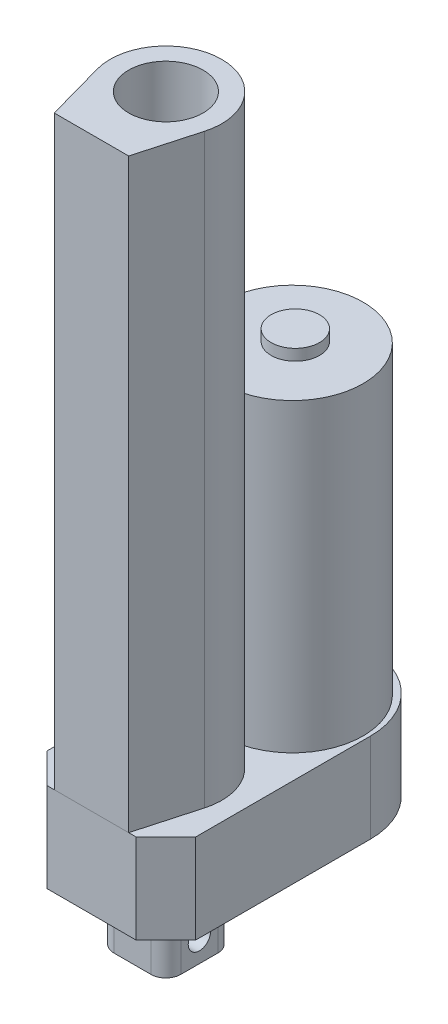
ISO-10303-21;
HEADER;
FILE_DESCRIPTION(('STEP AP214'),'2;1');
FILE_NAME('part.step','',(''),(''),'','','');
FILE_SCHEMA(('AUTOMOTIVE_DESIGN { 1 0 10303 214 1 1 1 1 }'));
ENDSEC;
DATA;
#1=APPLICATION_CONTEXT('core data for automotive mechanical design processes');
#2=APPLICATION_PROTOCOL_DEFINITION('international standard','automotive_design',2000,#1);
#3=PRODUCT_CONTEXT('',#1,'mechanical');
#4=PRODUCT('Part','Part','',(#3));
#5=PRODUCT_RELATED_PRODUCT_CATEGORY('part','',(#4));
#6=PRODUCT_DEFINITION_FORMATION('','',#4);
#7=PRODUCT_DEFINITION_CONTEXT('part definition',#1,'design');
#8=PRODUCT_DEFINITION('design','',#6,#7);
#9=PRODUCT_DEFINITION_SHAPE('','',#8);
#10=(LENGTH_UNIT() NAMED_UNIT(*) SI_UNIT(.MILLI.,.METRE.));
#11=(NAMED_UNIT(*) PLANE_ANGLE_UNIT() SI_UNIT($,.RADIAN.));
#12=(NAMED_UNIT(*) SI_UNIT($,.STERADIAN.) SOLID_ANGLE_UNIT());
#13=UNCERTAINTY_MEASURE_WITH_UNIT(LENGTH_MEASURE(1.E-05),#10,'distance_accuracy_value','');
#14=(GEOMETRIC_REPRESENTATION_CONTEXT(3) GLOBAL_UNCERTAINTY_ASSIGNED_CONTEXT((#13)) GLOBAL_UNIT_ASSIGNED_CONTEXT((#10,
#11,#12)) REPRESENTATION_CONTEXT('',''));
#15=CARTESIAN_POINT('',(0.,0.,0.));
#16=DIRECTION('',(0.,0.,1.));
#17=DIRECTION('',(1.,0.,0.));
#18=AXIS2_PLACEMENT_3D('',#15,#16,#17);
#19=CARTESIAN_POINT('',(20.,181.5,-20.));
#20=DIRECTION('',(0.,1.,0.));
#21=DIRECTION('',(0.,0.,1.));
#22=AXIS2_PLACEMENT_3D('',#19,#20,#21);
#23=PLANE('',#22);
#24=DIRECTION('',(1.,0.,0.));
#25=VECTOR('',#24,1.);
#26=CARTESIAN_POINT('',(30.,181.5,0.));
#27=LINE('',#26,#25);
#28=CARTESIAN_POINT('',(10.,181.5,0.));
#29=VERTEX_POINT('',#28);
#30=CARTESIAN_POINT('',(30.,181.5,0.));
#31=VERTEX_POINT('',#30);
#32=EDGE_CURVE('E96',#29,#31,#27,.T.);
#33=ORIENTED_EDGE('',*,*,#32,.T.);
#34=DIRECTION('',(0.26833752096446,0.,-0.96332495807108));
#35=VECTOR('',#34,1.);
#36=CARTESIAN_POINT('',(30.,181.5,0.));
#37=LINE('',#36,#35);
#38=CARTESIAN_POINT('',(34.4498743710662,181.5,-15.9749371855331));
#39=VERTEX_POINT('',#38);
#40=EDGE_CURVE('E91',#31,#39,#37,.T.);
#41=ORIENTED_EDGE('',*,*,#40,.T.);
#42=CARTESIAN_POINT('',(20.,181.5,-20.));
#43=DIRECTION('',(0.,1.,0.));
#44=DIRECTION('',(0.,0.,1.));
#45=AXIS2_PLACEMENT_3D('',#42,#43,#44);
#46=CIRCLE('',#45,15.);
#47=CARTESIAN_POINT('',(5.5501256289338,181.5,-15.9749371855331));
#48=VERTEX_POINT('',#47);
#49=EDGE_CURVE('E94',#39,#48,#46,.T.);
#50=ORIENTED_EDGE('',*,*,#49,.T.);
#51=DIRECTION('',(0.26833752096446,0.,0.96332495807108));
#52=VECTOR('',#51,1.);
#53=CARTESIAN_POINT('',(10.,181.5,0.));
#54=LINE('',#53,#52);
#55=EDGE_CURVE('E61',#48,#29,#54,.T.);
#56=ORIENTED_EDGE('',*,*,#55,.T.);
#57=EDGE_LOOP('',(#33,#41,#50,#56));
#58=FACE_BOUND('',#57,.T.);
#59=CARTESIAN_POINT('',(20.,181.5,-20.));
#60=DIRECTION('',(0.,1.,0.));
#61=DIRECTION('',(0.,0.,1.));
#62=AXIS2_PLACEMENT_3D('',#59,#60,#61);
#63=CIRCLE('',#62,10.);
#64=CARTESIAN_POINT('',(20.,181.5,-9.99999999999999));
#65=VERTEX_POINT('',#64);
#66=EDGE_CURVE('E111',#65,#65,#63,.T.);
#67=ORIENTED_EDGE('',*,*,#66,.F.);
#68=EDGE_LOOP('',(#67));
#69=FACE_BOUND('',#68,.T.);
#70=ADVANCED_FACE('F44',(#58,#69),#23,.T.);
#71=CARTESIAN_POINT('',(20.,24.,-20.));
#72=DIRECTION('',(0.,1.,0.));
#73=DIRECTION('',(0.,0.,1.));
#74=AXIS2_PLACEMENT_3D('',#71,#72,#73);
#75=PLANE('',#74);
#76=DIRECTION('',(1.,0.,0.));
#77=VECTOR('',#76,1.);
#78=CARTESIAN_POINT('',(30.,24.,0.));
#79=LINE('',#78,#77);
#80=CARTESIAN_POINT('',(10.,24.,0.));
#81=VERTEX_POINT('',#80);
#82=CARTESIAN_POINT('',(30.,24.,0.));
#83=VERTEX_POINT('',#82);
#84=EDGE_CURVE('E108',#81,#83,#79,.T.);
#85=ORIENTED_EDGE('',*,*,#84,.F.);
#86=DIRECTION('',(0.26833752096446,0.,0.96332495807108));
#87=VECTOR('',#86,1.);
#88=CARTESIAN_POINT('',(10.,24.,0.));
#89=LINE('',#88,#87);
#90=CARTESIAN_POINT('',(5.5501256289338,24.,-15.9749371855331));
#91=VERTEX_POINT('',#90);
#92=EDGE_CURVE('E84',#91,#81,#89,.T.);
#93=ORIENTED_EDGE('',*,*,#92,.F.);
#94=CARTESIAN_POINT('',(20.,24.,-20.));
#95=DIRECTION('',(0.,1.,0.));
#96=DIRECTION('',(0.,0.,1.));
#97=AXIS2_PLACEMENT_3D('',#94,#95,#96);
#98=CIRCLE('',#97,15.);
#99=CARTESIAN_POINT('',(34.4498743710662,24.,-15.9749371855331));
#100=VERTEX_POINT('',#99);
#101=EDGE_CURVE('E78',#100,#91,#98,.T.);
#102=ORIENTED_EDGE('',*,*,#101,.F.);
#103=DIRECTION('',(0.26833752096446,0.,-0.96332495807108));
#104=VECTOR('',#103,1.);
#105=CARTESIAN_POINT('',(30.,24.,0.));
#106=LINE('',#105,#104);
#107=EDGE_CURVE('E100',#83,#100,#106,.T.);
#108=ORIENTED_EDGE('',*,*,#107,.F.);
#109=EDGE_LOOP('',(#85,#93,#102,#108));
#110=FACE_BOUND('',#109,.T.);
#111=CARTESIAN_POINT('',(20.,24.,-20.));
#112=DIRECTION('',(0.,1.,0.));
#113=DIRECTION('',(0.,0.,1.));
#114=AXIS2_PLACEMENT_3D('',#111,#112,#113);
#115=CIRCLE('',#114,10.);
#116=CARTESIAN_POINT('',(20.,24.,-9.99999999999999));
#117=VERTEX_POINT('',#116);
#118=EDGE_CURVE('E123',#117,#117,#115,.T.);
#119=ORIENTED_EDGE('',*,*,#118,.T.);
#120=EDGE_LOOP('',(#119));
#121=FACE_BOUND('',#120,.T.);
#122=ADVANCED_FACE('F119',(#110,#121),#75,.F.);
#123=CARTESIAN_POINT('',(30.,181.5,0.));
#124=DIRECTION('',(0.,0.,-1.));
#125=DIRECTION('',(-1.,0.,0.));
#126=AXIS2_PLACEMENT_3D('',#123,#124,#125);
#127=PLANE('',#126);
#128=ORIENTED_EDGE('',*,*,#84,.T.);
#129=DIRECTION('',(0.,-1.,0.));
#130=VECTOR('',#129,1.);
#131=CARTESIAN_POINT('',(30.,181.5,0.));
#132=LINE('',#131,#130);
#133=EDGE_CURVE('E12',#31,#83,#132,.T.);
#134=ORIENTED_EDGE('',*,*,#133,.F.);
#135=ORIENTED_EDGE('',*,*,#32,.F.);
#136=DIRECTION('',(0.,-1.,0.));
#137=VECTOR('',#136,1.);
#138=CARTESIAN_POINT('',(10.,181.5,0.));
#139=LINE('',#138,#137);
#140=EDGE_CURVE('E104',#29,#81,#139,.T.);
#141=ORIENTED_EDGE('',*,*,#140,.T.);
#142=EDGE_LOOP('',(#128,#134,#135,#141));
#143=FACE_BOUND('',#142,.T.);
#144=ADVANCED_FACE('F46',(#143),#127,.F.);
#145=CARTESIAN_POINT('',(30.,181.5,0.));
#146=DIRECTION('',(-0.96332495807108,0.,-0.26833752096446));
#147=DIRECTION('',(-0.26833752096446,0.,0.96332495807108));
#148=AXIS2_PLACEMENT_3D('',#145,#146,#147);
#149=PLANE('',#148);
#150=ORIENTED_EDGE('',*,*,#107,.T.);
#151=DIRECTION('',(0.,-1.,0.));
#152=VECTOR('',#151,1.);
#153=CARTESIAN_POINT('',(34.4498743710662,181.5,-15.9749371855331));
#154=LINE('',#153,#152);
#155=EDGE_CURVE('E53',#39,#100,#154,.T.);
#156=ORIENTED_EDGE('',*,*,#155,.F.);
#157=ORIENTED_EDGE('',*,*,#40,.F.);
#158=ORIENTED_EDGE('',*,*,#133,.T.);
#159=EDGE_LOOP('',(#150,#156,#157,#158));
#160=FACE_BOUND('',#159,.T.);
#161=ADVANCED_FACE('F99',(#160),#149,.F.);
#162=CARTESIAN_POINT('',(20.,181.5,-20.));
#163=DIRECTION('',(0.,-1.,0.));
#164=DIRECTION('',(0.,0.,-1.));
#165=AXIS2_PLACEMENT_3D('',#162,#163,#164);
#166=CYLINDRICAL_SURFACE('',#165,15.);
#167=ORIENTED_EDGE('',*,*,#101,.T.);
#168=DIRECTION('',(0.,-1.,0.));
#169=VECTOR('',#168,1.);
#170=CARTESIAN_POINT('',(5.5501256289338,181.5,-15.9749371855331));
#171=LINE('',#170,#169);
#172=EDGE_CURVE('E101',#48,#91,#171,.T.);
#173=ORIENTED_EDGE('',*,*,#172,.F.);
#174=ORIENTED_EDGE('',*,*,#49,.F.);
#175=ORIENTED_EDGE('',*,*,#155,.T.);
#176=EDGE_LOOP('',(#167,#173,#174,#175));
#177=FACE_BOUND('',#176,.T.);
#178=ADVANCED_FACE('F102',(#177),#166,.T.);
#179=CARTESIAN_POINT('',(10.,181.5,0.));
#180=DIRECTION('',(0.96332495807108,0.,-0.26833752096446));
#181=DIRECTION('',(-0.26833752096446,0.,-0.96332495807108));
#182=AXIS2_PLACEMENT_3D('',#179,#180,#181);
#183=PLANE('',#182);
#184=ORIENTED_EDGE('',*,*,#92,.T.);
#185=ORIENTED_EDGE('',*,*,#140,.F.);
#186=ORIENTED_EDGE('',*,*,#55,.F.);
#187=ORIENTED_EDGE('',*,*,#172,.T.);
#188=EDGE_LOOP('',(#184,#185,#186,#187));
#189=FACE_BOUND('',#188,.T.);
#190=ADVANCED_FACE('F116',(#189),#183,.F.);
#191=CARTESIAN_POINT('',(20.,181.5,-20.));
#192=DIRECTION('',(0.,-1.,0.));
#193=DIRECTION('',(0.,0.,-1.));
#194=AXIS2_PLACEMENT_3D('',#191,#192,#193);
#195=CYLINDRICAL_SURFACE('',#194,10.);
#196=ORIENTED_EDGE('',*,*,#66,.T.);
#197=EDGE_LOOP('',(#196));
#198=FACE_BOUND('',#197,.T.);
#199=ORIENTED_EDGE('',*,*,#118,.F.);
#200=EDGE_LOOP('',(#199));
#201=FACE_BOUND('',#200,.T.);
#202=ADVANCED_FACE('F129',(#198,#201),#195,.F.);
#203=CLOSED_SHELL('',(#70,#122,#144,#161,#178,#190,#202));
#204=MANIFOLD_SOLID_BREP('B2',#203);
#205=CARTESIAN_POINT('',(20.,0.,-55.));
#206=DIRECTION('',(0.,1.,0.));
#207=DIRECTION('',(0.,0.,1.));
#208=AXIS2_PLACEMENT_3D('',#205,#206,#207);
#209=PLANE('',#208);
#210=DIRECTION('',(1.,0.,0.));
#211=VECTOR('',#210,1.);
#212=CARTESIAN_POINT('',(8.,0.,0.));
#213=LINE('',#212,#211);
#214=CARTESIAN_POINT('',(8.,0.,0.));
#215=VERTEX_POINT('',#214);
#216=CARTESIAN_POINT('',(32.,0.,0.));
#217=VERTEX_POINT('',#216);
#218=EDGE_CURVE('E312',#215,#217,#213,.T.);
#219=ORIENTED_EDGE('',*,*,#218,.F.);
#220=DIRECTION('',(0.707106781186548,0.,0.707106781186548));
#221=VECTOR('',#220,1.);
#222=CARTESIAN_POINT('',(0.,0.,-8.));
#223=LINE('',#222,#221);
#224=CARTESIAN_POINT('',(0.,0.,-8.));
#225=VERTEX_POINT('',#224);
#226=EDGE_CURVE('E325',#225,#215,#223,.T.);
#227=ORIENTED_EDGE('',*,*,#226,.F.);
#228=DIRECTION('',(0.,0.,1.));
#229=VECTOR('',#228,1.);
#230=CARTESIAN_POINT('',(0.,0.,-8.));
#231=LINE('',#230,#229);
#232=CARTESIAN_POINT('',(0.,0.,-55.));
#233=VERTEX_POINT('',#232);
#234=EDGE_CURVE('E341',#233,#225,#231,.T.);
#235=ORIENTED_EDGE('',*,*,#234,.F.);
#236=CARTESIAN_POINT('',(20.,0.,-55.));
#237=DIRECTION('',(0.,1.,0.));
#238=DIRECTION('',(0.,0.,1.));
#239=AXIS2_PLACEMENT_3D('',#236,#237,#238);
#240=CIRCLE('',#239,20.);
#241=CARTESIAN_POINT('',(40.,0.,-55.));
#242=VERTEX_POINT('',#241);
#243=EDGE_CURVE('E339',#242,#233,#240,.T.);
#244=ORIENTED_EDGE('',*,*,#243,.F.);
#245=DIRECTION('',(0.,0.,-1.));
#246=VECTOR('',#245,1.);
#247=CARTESIAN_POINT('',(40.,0.,-8.));
#248=LINE('',#247,#246);
#249=CARTESIAN_POINT('',(40.,0.,-8.));
#250=VERTEX_POINT('',#249);
#251=EDGE_CURVE('E337',#250,#242,#248,.T.);
#252=ORIENTED_EDGE('',*,*,#251,.F.);
#253=DIRECTION('',(0.707106781186548,0.,-0.707106781186548));
#254=VECTOR('',#253,1.);
#255=CARTESIAN_POINT('',(32.,0.,0.));
#256=LINE('',#255,#254);
#257=EDGE_CURVE('E315',#217,#250,#256,.T.);
#258=ORIENTED_EDGE('',*,*,#257,.F.);
#259=EDGE_LOOP('',(#219,#227,#235,#244,#252,#258));
#260=FACE_BOUND('',#259,.T.);
#261=CARTESIAN_POINT('',(15.,0.,-25.));
#262=DIRECTION('',(0.,-1.,0.));
#263=DIRECTION('',(0.,0.,-1.));
#264=AXIS2_PLACEMENT_3D('',#261,#262,#263);
#265=CIRCLE('',#264,4.);
#266=CARTESIAN_POINT('',(11.,0.,-25.));
#267=VERTEX_POINT('',#266);
#268=CARTESIAN_POINT('',(15.,0.,-29.));
#269=VERTEX_POINT('',#268);
#270=EDGE_CURVE('E311',#267,#269,#265,.T.);
#271=ORIENTED_EDGE('',*,*,#270,.F.);
#272=DIRECTION('',(0.,0.,-1.));
#273=VECTOR('',#272,1.);
#274=CARTESIAN_POINT('',(11.,0.,-15.));
#275=LINE('',#274,#273);
#276=CARTESIAN_POINT('',(11.,0.,-15.));
#277=VERTEX_POINT('',#276);
#278=EDGE_CURVE('E308',#277,#267,#275,.T.);
#279=ORIENTED_EDGE('',*,*,#278,.F.);
#280=CARTESIAN_POINT('',(15.,0.,-15.));
#281=DIRECTION('',(0.,-1.,0.));
#282=DIRECTION('',(0.,0.,-1.));
#283=AXIS2_PLACEMENT_3D('',#280,#281,#282);
#284=CIRCLE('',#283,4.);
#285=CARTESIAN_POINT('',(15.,0.,-11.));
#286=VERTEX_POINT('',#285);
#287=EDGE_CURVE('E493',#286,#277,#284,.T.);
#288=ORIENTED_EDGE('',*,*,#287,.F.);
#289=DIRECTION('',(-1.,0.,0.));
#290=VECTOR('',#289,1.);
#291=CARTESIAN_POINT('',(15.,0.,-11.));
#292=LINE('',#291,#290);
#293=CARTESIAN_POINT('',(25.,0.,-11.));
#294=VERTEX_POINT('',#293);
#295=EDGE_CURVE('E490',#294,#286,#292,.T.);
#296=ORIENTED_EDGE('',*,*,#295,.F.);
#297=CARTESIAN_POINT('',(25.,0.,-15.));
#298=DIRECTION('',(0.,-1.,0.));
#299=DIRECTION('',(0.,0.,1.));
#300=AXIS2_PLACEMENT_3D('',#297,#298,#299);
#301=CIRCLE('',#300,4.);
#302=CARTESIAN_POINT('',(29.,0.,-15.));
#303=VERTEX_POINT('',#302);
#304=EDGE_CURVE('E487',#303,#294,#301,.T.);
#305=ORIENTED_EDGE('',*,*,#304,.F.);
#306=DIRECTION('',(0.,0.,1.));
#307=VECTOR('',#306,1.);
#308=CARTESIAN_POINT('',(29.,0.,-15.));
#309=LINE('',#308,#307);
#310=CARTESIAN_POINT('',(29.,0.,-25.));
#311=VERTEX_POINT('',#310);
#312=EDGE_CURVE('E484',#311,#303,#309,.T.);
#313=ORIENTED_EDGE('',*,*,#312,.F.);
#314=CARTESIAN_POINT('',(25.,0.,-25.));
#315=DIRECTION('',(0.,-1.,0.));
#316=DIRECTION('',(0.,0.,-1.));
#317=AXIS2_PLACEMENT_3D('',#314,#315,#316);
#318=CIRCLE('',#317,4.);
#319=CARTESIAN_POINT('',(25.,0.,-29.));
#320=VERTEX_POINT('',#319);
#321=EDGE_CURVE('E210',#320,#311,#318,.T.);
#322=ORIENTED_EDGE('',*,*,#321,.F.);
#323=DIRECTION('',(1.,0.,0.));
#324=VECTOR('',#323,1.);
#325=CARTESIAN_POINT('',(15.,0.,-29.));
#326=LINE('',#325,#324);
#327=EDGE_CURVE('E205',#269,#320,#326,.T.);
#328=ORIENTED_EDGE('',*,*,#327,.F.);
#329=EDGE_LOOP('',(#271,#279,#288,#296,#305,#313,#322,#328));
#330=FACE_BOUND('',#329,.T.);
#331=ADVANCED_FACE('F188',(#260,#330),#209,.F.);
#332=CARTESIAN_POINT('',(8.,24.,0.));
#333=DIRECTION('',(0.,0.,-1.));
#334=DIRECTION('',(-1.,0.,0.));
#335=AXIS2_PLACEMENT_3D('',#332,#333,#334);
#336=PLANE('',#335);
#337=ORIENTED_EDGE('',*,*,#218,.T.);
#338=DIRECTION('',(0.,-1.,0.));
#339=VECTOR('',#338,1.);
#340=CARTESIAN_POINT('',(32.,24.,0.));
#341=LINE('',#340,#339);
#342=CARTESIAN_POINT('',(32.,24.,0.));
#343=VERTEX_POINT('',#342);
#344=EDGE_CURVE('E197',#343,#217,#341,.T.);
#345=ORIENTED_EDGE('',*,*,#344,.F.);
#346=DIRECTION('',(1.,0.,0.));
#347=VECTOR('',#346,1.);
#348=CARTESIAN_POINT('',(8.,24.,0.));
#349=LINE('',#348,#347);
#350=CARTESIAN_POINT('',(8.,24.,0.));
#351=VERTEX_POINT('',#350);
#352=EDGE_CURVE('E321',#351,#343,#349,.T.);
#353=ORIENTED_EDGE('',*,*,#352,.F.);
#354=DIRECTION('',(0.,-1.,0.));
#355=VECTOR('',#354,1.);
#356=CARTESIAN_POINT('',(8.,24.,0.));
#357=LINE('',#356,#355);
#358=EDGE_CURVE('E334',#351,#215,#357,.T.);
#359=ORIENTED_EDGE('',*,*,#358,.T.);
#360=EDGE_LOOP('',(#337,#345,#353,#359));
#361=FACE_BOUND('',#360,.T.);
#362=ADVANCED_FACE('F190',(#361),#336,.F.);
#363=CARTESIAN_POINT('',(32.,24.,0.));
#364=DIRECTION('',(-0.707106781186547,0.,-0.707106781186547));
#365=DIRECTION('',(-0.707106781186548,0.,0.707106781186548));
#366=AXIS2_PLACEMENT_3D('',#363,#364,#365);
#367=PLANE('',#366);
#368=ORIENTED_EDGE('',*,*,#257,.T.);
#369=DIRECTION('',(0.,-1.,0.));
#370=VECTOR('',#369,1.);
#371=CARTESIAN_POINT('',(40.,24.,-8.));
#372=LINE('',#371,#370);
#373=CARTESIAN_POINT('',(40.,24.,-8.));
#374=VERTEX_POINT('',#373);
#375=EDGE_CURVE('E355',#374,#250,#372,.T.);
#376=ORIENTED_EDGE('',*,*,#375,.F.);
#377=DIRECTION('',(0.707106781186548,0.,-0.707106781186548));
#378=VECTOR('',#377,1.);
#379=CARTESIAN_POINT('',(32.,24.,0.));
#380=LINE('',#379,#378);
#381=EDGE_CURVE('E324',#343,#374,#380,.T.);
#382=ORIENTED_EDGE('',*,*,#381,.F.);
#383=ORIENTED_EDGE('',*,*,#344,.T.);
#384=EDGE_LOOP('',(#368,#376,#382,#383));
#385=FACE_BOUND('',#384,.T.);
#386=ADVANCED_FACE('F360',(#385),#367,.F.);
#387=CARTESIAN_POINT('',(40.,24.,-8.));
#388=DIRECTION('',(-1.,0.,0.));
#389=DIRECTION('',(0.,0.,1.));
#390=AXIS2_PLACEMENT_3D('',#387,#388,#389);
#391=PLANE('',#390);
#392=ORIENTED_EDGE('',*,*,#251,.T.);
#393=DIRECTION('',(0.,-1.,0.));
#394=VECTOR('',#393,1.);
#395=CARTESIAN_POINT('',(40.,24.,-55.));
#396=LINE('',#395,#394);
#397=CARTESIAN_POINT('',(40.,24.,-55.));
#398=VERTEX_POINT('',#397);
#399=EDGE_CURVE('E352',#398,#242,#396,.T.);
#400=ORIENTED_EDGE('',*,*,#399,.F.);
#401=DIRECTION('',(0.,0.,-1.));
#402=VECTOR('',#401,1.);
#403=CARTESIAN_POINT('',(40.,24.,-8.));
#404=LINE('',#403,#402);
#405=EDGE_CURVE('E327',#374,#398,#404,.T.);
#406=ORIENTED_EDGE('',*,*,#405,.F.);
#407=ORIENTED_EDGE('',*,*,#375,.T.);
#408=EDGE_LOOP('',(#392,#400,#406,#407));
#409=FACE_BOUND('',#408,.T.);
#410=ADVANCED_FACE('F373',(#409),#391,.F.);
#411=CARTESIAN_POINT('',(20.,24.,-55.));
#412=DIRECTION('',(0.,-1.,0.));
#413=DIRECTION('',(0.,0.,-1.));
#414=AXIS2_PLACEMENT_3D('',#411,#412,#413);
#415=CYLINDRICAL_SURFACE('',#414,20.);
#416=ORIENTED_EDGE('',*,*,#243,.T.);
#417=DIRECTION('',(0.,-1.,0.));
#418=VECTOR('',#417,1.);
#419=CARTESIAN_POINT('',(0.,24.,-55.));
#420=LINE('',#419,#418);
#421=CARTESIAN_POINT('',(0.,24.,-55.));
#422=VERTEX_POINT('',#421);
#423=EDGE_CURVE('E349',#422,#233,#420,.T.);
#424=ORIENTED_EDGE('',*,*,#423,.F.);
#425=CARTESIAN_POINT('',(20.,24.,-55.));
#426=DIRECTION('',(0.,1.,0.));
#427=DIRECTION('',(0.,0.,1.));
#428=AXIS2_PLACEMENT_3D('',#425,#426,#427);
#429=CIRCLE('',#428,20.);
#430=EDGE_CURVE('E329',#398,#422,#429,.T.);
#431=ORIENTED_EDGE('',*,*,#430,.F.);
#432=ORIENTED_EDGE('',*,*,#399,.T.);
#433=EDGE_LOOP('',(#416,#424,#431,#432));
#434=FACE_BOUND('',#433,.T.);
#435=ADVANCED_FACE('F377',(#434),#415,.T.);
#436=CARTESIAN_POINT('',(0.,24.,-8.));
#437=DIRECTION('',(1.,0.,0.));
#438=DIRECTION('',(0.,0.,-1.));
#439=AXIS2_PLACEMENT_3D('',#436,#437,#438);
#440=PLANE('',#439);
#441=ORIENTED_EDGE('',*,*,#234,.T.);
#442=DIRECTION('',(0.,-1.,0.));
#443=VECTOR('',#442,1.);
#444=CARTESIAN_POINT('',(0.,24.,-8.));
#445=LINE('',#444,#443);
#446=CARTESIAN_POINT('',(0.,24.,-8.));
#447=VERTEX_POINT('',#446);
#448=EDGE_CURVE('E346',#447,#225,#445,.T.);
#449=ORIENTED_EDGE('',*,*,#448,.F.);
#450=DIRECTION('',(0.,0.,1.));
#451=VECTOR('',#450,1.);
#452=CARTESIAN_POINT('',(0.,24.,-8.));
#453=LINE('',#452,#451);
#454=EDGE_CURVE('E331',#422,#447,#453,.T.);
#455=ORIENTED_EDGE('',*,*,#454,.F.);
#456=ORIENTED_EDGE('',*,*,#423,.T.);
#457=EDGE_LOOP('',(#441,#449,#455,#456));
#458=FACE_BOUND('',#457,.T.);
#459=ADVANCED_FACE('F387',(#458),#440,.F.);
#460=CARTESIAN_POINT('',(0.,24.,-8.));
#461=DIRECTION('',(0.707106781186547,0.,-0.707106781186547));
#462=DIRECTION('',(-0.707106781186548,0.,-0.707106781186548));
#463=AXIS2_PLACEMENT_3D('',#460,#461,#462);
#464=PLANE('',#463);
#465=ORIENTED_EDGE('',*,*,#226,.T.);
#466=ORIENTED_EDGE('',*,*,#358,.F.);
#467=DIRECTION('',(0.707106781186548,0.,0.707106781186548));
#468=VECTOR('',#467,1.);
#469=CARTESIAN_POINT('',(0.,24.,-8.));
#470=LINE('',#469,#468);
#471=EDGE_CURVE('E333',#447,#351,#470,.T.);
#472=ORIENTED_EDGE('',*,*,#471,.F.);
#473=ORIENTED_EDGE('',*,*,#448,.T.);
#474=EDGE_LOOP('',(#465,#466,#472,#473));
#475=FACE_BOUND('',#474,.T.);
#476=ADVANCED_FACE('F385',(#475),#464,.F.);
#477=CARTESIAN_POINT('',(20.,24.,-55.));
#478=DIRECTION('',(0.,1.,0.));
#479=DIRECTION('',(0.,0.,1.));
#480=AXIS2_PLACEMENT_3D('',#477,#478,#479);
#481=PLANE('',#480);
#482=CARTESIAN_POINT('',(20.,24.,-54.));
#483=DIRECTION('',(0.,1.,0.));
#484=DIRECTION('',(0.,0.,1.));
#485=AXIS2_PLACEMENT_3D('',#482,#483,#484);
#486=CIRCLE('',#485,19.);
#487=CARTESIAN_POINT('',(20.,24.,-35.));
#488=VERTEX_POINT('',#487);
#489=EDGE_CURVE('E459',#488,#488,#486,.T.);
#490=ORIENTED_EDGE('',*,*,#489,.F.);
#491=EDGE_LOOP('',(#490));
#492=FACE_BOUND('',#491,.T.);
#493=ORIENTED_EDGE('',*,*,#352,.T.);
#494=ORIENTED_EDGE('',*,*,#381,.T.);
#495=ORIENTED_EDGE('',*,*,#405,.T.);
#496=ORIENTED_EDGE('',*,*,#430,.T.);
#497=ORIENTED_EDGE('',*,*,#454,.T.);
#498=ORIENTED_EDGE('',*,*,#471,.T.);
#499=EDGE_LOOP('',(#493,#494,#495,#496,#497,#498));
#500=FACE_BOUND('',#499,.T.);
#501=ADVANCED_FACE('F381',(#492,#500),#481,.T.);
#502=CARTESIAN_POINT('',(15.,-17.,-25.));
#503=DIRECTION('',(0.,1.,0.));
#504=DIRECTION('',(0.,0.,1.));
#505=AXIS2_PLACEMENT_3D('',#502,#503,#504);
#506=CYLINDRICAL_SURFACE('',#505,4.);
#507=ORIENTED_EDGE('',*,*,#270,.T.);
#508=DIRECTION('',(0.,1.,0.));
#509=VECTOR('',#508,1.);
#510=CARTESIAN_POINT('',(15.,-17.,-29.));
#511=LINE('',#510,#509);
#512=CARTESIAN_POINT('',(15.,-17.,-29.));
#513=VERTEX_POINT('',#512);
#514=EDGE_CURVE('E292',#513,#269,#511,.T.);
#515=ORIENTED_EDGE('',*,*,#514,.F.);
#516=CARTESIAN_POINT('',(15.,-17.,-25.));
#517=DIRECTION('',(0.,-1.,0.));
#518=DIRECTION('',(0.,0.,-1.));
#519=AXIS2_PLACEMENT_3D('',#516,#517,#518);
#520=CIRCLE('',#519,4.);
#521=CARTESIAN_POINT('',(11.,-17.,-25.));
#522=VERTEX_POINT('',#521);
#523=EDGE_CURVE('E299',#522,#513,#520,.T.);
#524=ORIENTED_EDGE('',*,*,#523,.F.);
#525=DIRECTION('',(0.,1.,0.));
#526=VECTOR('',#525,1.);
#527=CARTESIAN_POINT('',(11.,-17.,-25.));
#528=LINE('',#527,#526);
#529=EDGE_CURVE('E480',#522,#267,#528,.T.);
#530=ORIENTED_EDGE('',*,*,#529,.T.);
#531=EDGE_LOOP('',(#507,#515,#524,#530));
#532=FACE_BOUND('',#531,.T.);
#533=ADVANCED_FACE('F310',(#532),#506,.T.);
#534=CARTESIAN_POINT('',(15.,-17.,-29.));
#535=DIRECTION('',(0.,0.,1.));
#536=DIRECTION('',(1.,0.,0.));
#537=AXIS2_PLACEMENT_3D('',#534,#535,#536);
#538=PLANE('',#537);
#539=ORIENTED_EDGE('',*,*,#327,.T.);
#540=DIRECTION('',(0.,1.,0.));
#541=VECTOR('',#540,1.);
#542=CARTESIAN_POINT('',(25.,-17.,-29.));
#543=LINE('',#542,#541);
#544=CARTESIAN_POINT('',(25.,-17.,-29.));
#545=VERTEX_POINT('',#544);
#546=EDGE_CURVE('E295',#545,#320,#543,.T.);
#547=ORIENTED_EDGE('',*,*,#546,.F.);
#548=DIRECTION('',(1.,0.,0.));
#549=VECTOR('',#548,1.);
#550=CARTESIAN_POINT('',(15.,-17.,-29.));
#551=LINE('',#550,#549);
#552=EDGE_CURVE('E288',#513,#545,#551,.T.);
#553=ORIENTED_EDGE('',*,*,#552,.F.);
#554=ORIENTED_EDGE('',*,*,#514,.T.);
#555=EDGE_LOOP('',(#539,#547,#553,#554));
#556=FACE_BOUND('',#555,.T.);
#557=ADVANCED_FACE('F290',(#556),#538,.F.);
#558=CARTESIAN_POINT('',(25.,-17.,-25.));
#559=DIRECTION('',(0.,1.,0.));
#560=DIRECTION('',(0.,0.,1.));
#561=AXIS2_PLACEMENT_3D('',#558,#559,#560);
#562=CYLINDRICAL_SURFACE('',#561,4.);
#563=ORIENTED_EDGE('',*,*,#321,.T.);
#564=DIRECTION('',(0.,1.,0.));
#565=VECTOR('',#564,1.);
#566=CARTESIAN_POINT('',(29.,-17.,-25.));
#567=LINE('',#566,#565);
#568=CARTESIAN_POINT('',(29.,-17.,-25.));
#569=VERTEX_POINT('',#568);
#570=EDGE_CURVE('E317',#569,#311,#567,.T.);
#571=ORIENTED_EDGE('',*,*,#570,.F.);
#572=CARTESIAN_POINT('',(25.,-17.,-25.));
#573=DIRECTION('',(0.,-1.,0.));
#574=DIRECTION('',(0.,0.,-1.));
#575=AXIS2_PLACEMENT_3D('',#572,#573,#574);
#576=CIRCLE('',#575,4.);
#577=EDGE_CURVE('E298',#545,#569,#576,.T.);
#578=ORIENTED_EDGE('',*,*,#577,.F.);
#579=ORIENTED_EDGE('',*,*,#546,.T.);
#580=EDGE_LOOP('',(#563,#571,#578,#579));
#581=FACE_BOUND('',#580,.T.);
#582=ADVANCED_FACE('F409',(#581),#562,.T.);
#583=CARTESIAN_POINT('',(29.,-17.,-15.));
#584=DIRECTION('',(-1.,0.,0.));
#585=DIRECTION('',(0.,0.,1.));
#586=AXIS2_PLACEMENT_3D('',#583,#584,#585);
#587=PLANE('',#586);
#588=CARTESIAN_POINT('',(29.,-11.,-20.));
#589=DIRECTION('',(-1.,0.,0.));
#590=DIRECTION('',(0.,0.,1.));
#591=AXIS2_PLACEMENT_3D('',#588,#589,#590);
#592=CIRCLE('',#591,3.);
#593=CARTESIAN_POINT('',(29.,-11.,-17.));
#594=VERTEX_POINT('',#593);
#595=EDGE_CURVE('E467',#594,#594,#592,.T.);
#596=ORIENTED_EDGE('',*,*,#595,.T.);
#597=EDGE_LOOP('',(#596));
#598=FACE_BOUND('',#597,.T.);
#599=ORIENTED_EDGE('',*,*,#312,.T.);
#600=DIRECTION('',(0.,1.,0.));
#601=VECTOR('',#600,1.);
#602=CARTESIAN_POINT('',(29.,-17.,-15.));
#603=LINE('',#602,#601);
#604=CARTESIAN_POINT('',(29.,-17.,-15.));
#605=VERTEX_POINT('',#604);
#606=EDGE_CURVE('E508',#605,#303,#603,.T.);
#607=ORIENTED_EDGE('',*,*,#606,.F.);
#608=DIRECTION('',(0.,0.,1.));
#609=VECTOR('',#608,1.);
#610=CARTESIAN_POINT('',(29.,-17.,-15.));
#611=LINE('',#610,#609);
#612=EDGE_CURVE('E471',#569,#605,#611,.T.);
#613=ORIENTED_EDGE('',*,*,#612,.F.);
#614=ORIENTED_EDGE('',*,*,#570,.T.);
#615=EDGE_LOOP('',(#599,#607,#613,#614));
#616=FACE_BOUND('',#615,.T.);
#617=ADVANCED_FACE('F412',(#598,#616),#587,.F.);
#618=CARTESIAN_POINT('',(25.,-17.,-15.));
#619=DIRECTION('',(0.,1.,0.));
#620=DIRECTION('',(0.,0.,1.));
#621=AXIS2_PLACEMENT_3D('',#618,#619,#620);
#622=CYLINDRICAL_SURFACE('',#621,4.);
#623=ORIENTED_EDGE('',*,*,#304,.T.);
#624=DIRECTION('',(0.,1.,0.));
#625=VECTOR('',#624,1.);
#626=CARTESIAN_POINT('',(25.,-17.,-11.));
#627=LINE('',#626,#625);
#628=CARTESIAN_POINT('',(25.,-17.,-11.));
#629=VERTEX_POINT('',#628);
#630=EDGE_CURVE('E505',#629,#294,#627,.T.);
#631=ORIENTED_EDGE('',*,*,#630,.F.);
#632=CARTESIAN_POINT('',(25.,-17.,-15.));
#633=DIRECTION('',(0.,-1.,0.));
#634=DIRECTION('',(0.,0.,1.));
#635=AXIS2_PLACEMENT_3D('',#632,#633,#634);
#636=CIRCLE('',#635,4.);
#637=EDGE_CURVE('E473',#605,#629,#636,.T.);
#638=ORIENTED_EDGE('',*,*,#637,.F.);
#639=ORIENTED_EDGE('',*,*,#606,.T.);
#640=EDGE_LOOP('',(#623,#631,#638,#639));
#641=FACE_BOUND('',#640,.T.);
#642=ADVANCED_FACE('F416',(#641),#622,.T.);
#643=CARTESIAN_POINT('',(15.,-17.,-11.));
#644=DIRECTION('',(0.,0.,-1.));
#645=DIRECTION('',(-1.,0.,0.));
#646=AXIS2_PLACEMENT_3D('',#643,#644,#645);
#647=PLANE('',#646);
#648=ORIENTED_EDGE('',*,*,#295,.T.);
#649=DIRECTION('',(0.,1.,0.));
#650=VECTOR('',#649,1.);
#651=CARTESIAN_POINT('',(15.,-17.,-11.));
#652=LINE('',#651,#650);
#653=CARTESIAN_POINT('',(15.,-17.,-11.));
#654=VERTEX_POINT('',#653);
#655=EDGE_CURVE('E502',#654,#286,#652,.T.);
#656=ORIENTED_EDGE('',*,*,#655,.F.);
#657=DIRECTION('',(-1.,0.,0.));
#658=VECTOR('',#657,1.);
#659=CARTESIAN_POINT('',(15.,-17.,-11.));
#660=LINE('',#659,#658);
#661=EDGE_CURVE('E475',#629,#654,#660,.T.);
#662=ORIENTED_EDGE('',*,*,#661,.F.);
#663=ORIENTED_EDGE('',*,*,#630,.T.);
#664=EDGE_LOOP('',(#648,#656,#662,#663));
#665=FACE_BOUND('',#664,.T.);
#666=ADVANCED_FACE('F420',(#665),#647,.F.);
#667=CARTESIAN_POINT('',(15.,-17.,-15.));
#668=DIRECTION('',(0.,1.,0.));
#669=DIRECTION('',(0.,0.,1.));
#670=AXIS2_PLACEMENT_3D('',#667,#668,#669);
#671=CYLINDRICAL_SURFACE('',#670,4.);
#672=ORIENTED_EDGE('',*,*,#287,.T.);
#673=DIRECTION('',(0.,1.,0.));
#674=VECTOR('',#673,1.);
#675=CARTESIAN_POINT('',(11.,-17.,-15.));
#676=LINE('',#675,#674);
#677=CARTESIAN_POINT('',(11.,-17.,-15.));
#678=VERTEX_POINT('',#677);
#679=EDGE_CURVE('E499',#678,#277,#676,.T.);
#680=ORIENTED_EDGE('',*,*,#679,.F.);
#681=CARTESIAN_POINT('',(15.,-17.,-15.));
#682=DIRECTION('',(0.,-1.,0.));
#683=DIRECTION('',(0.,0.,-1.));
#684=AXIS2_PLACEMENT_3D('',#681,#682,#683);
#685=CIRCLE('',#684,4.);
#686=EDGE_CURVE('E477',#654,#678,#685,.T.);
#687=ORIENTED_EDGE('',*,*,#686,.F.);
#688=ORIENTED_EDGE('',*,*,#655,.T.);
#689=EDGE_LOOP('',(#672,#680,#687,#688));
#690=FACE_BOUND('',#689,.T.);
#691=ADVANCED_FACE('F424',(#690),#671,.T.);
#692=CARTESIAN_POINT('',(11.,-17.,-15.));
#693=DIRECTION('',(1.,0.,0.));
#694=DIRECTION('',(0.,0.,-1.));
#695=AXIS2_PLACEMENT_3D('',#692,#693,#694);
#696=PLANE('',#695);
#697=CARTESIAN_POINT('',(11.,-11.,-20.));
#698=DIRECTION('',(1.,0.,0.));
#699=DIRECTION('',(0.,0.,-1.));
#700=AXIS2_PLACEMENT_3D('',#697,#698,#699);
#701=CIRCLE('',#700,3.);
#702=CARTESIAN_POINT('',(11.,-11.,-23.));
#703=VERTEX_POINT('',#702);
#704=EDGE_CURVE('E192',#703,#703,#701,.T.);
#705=ORIENTED_EDGE('',*,*,#704,.T.);
#706=EDGE_LOOP('',(#705));
#707=FACE_BOUND('',#706,.T.);
#708=ORIENTED_EDGE('',*,*,#278,.T.);
#709=ORIENTED_EDGE('',*,*,#529,.F.);
#710=DIRECTION('',(0.,0.,-1.));
#711=VECTOR('',#710,1.);
#712=CARTESIAN_POINT('',(11.,-17.,-15.));
#713=LINE('',#712,#711);
#714=EDGE_CURVE('E304',#678,#522,#713,.T.);
#715=ORIENTED_EDGE('',*,*,#714,.F.);
#716=ORIENTED_EDGE('',*,*,#679,.T.);
#717=EDGE_LOOP('',(#708,#709,#715,#716));
#718=FACE_BOUND('',#717,.T.);
#719=ADVANCED_FACE('F428',(#707,#718),#696,.F.);
#720=CARTESIAN_POINT('',(15.,-17.,-25.));
#721=DIRECTION('',(0.,-1.,0.));
#722=DIRECTION('',(0.,0.,-1.));
#723=AXIS2_PLACEMENT_3D('',#720,#721,#722);
#724=PLANE('',#723);
#725=ORIENTED_EDGE('',*,*,#523,.T.);
#726=ORIENTED_EDGE('',*,*,#552,.T.);
#727=ORIENTED_EDGE('',*,*,#577,.T.);
#728=ORIENTED_EDGE('',*,*,#612,.T.);
#729=ORIENTED_EDGE('',*,*,#637,.T.);
#730=ORIENTED_EDGE('',*,*,#661,.T.);
#731=ORIENTED_EDGE('',*,*,#686,.T.);
#732=ORIENTED_EDGE('',*,*,#714,.T.);
#733=EDGE_LOOP('',(#725,#726,#727,#728,#729,#730,#731,#732));
#734=FACE_BOUND('',#733,.T.);
#735=ADVANCED_FACE('F302',(#734),#724,.T.);
#736=CARTESIAN_POINT('',(0.,-11.,-20.));
#737=DIRECTION('',(1.,0.,0.));
#738=DIRECTION('',(0.,0.,-1.));
#739=AXIS2_PLACEMENT_3D('',#736,#737,#738);
#740=CYLINDRICAL_SURFACE('',#739,3.);
#741=ORIENTED_EDGE('',*,*,#704,.F.);
#742=EDGE_LOOP('',(#741));
#743=FACE_BOUND('',#742,.T.);
#744=ORIENTED_EDGE('',*,*,#595,.F.);
#745=EDGE_LOOP('',(#744));
#746=FACE_BOUND('',#745,.T.);
#747=ADVANCED_FACE('F435',(#743,#746),#740,.F.);
#748=CARTESIAN_POINT('',(20.,106.,-54.));
#749=DIRECTION('',(0.,-1.,0.));
#750=DIRECTION('',(0.,0.,-1.));
#751=AXIS2_PLACEMENT_3D('',#748,#749,#750);
#752=CYLINDRICAL_SURFACE('',#751,19.);
#753=CARTESIAN_POINT('',(20.,106.,-54.));
#754=DIRECTION('',(0.,1.,0.));
#755=DIRECTION('',(0.,0.,1.));
#756=AXIS2_PLACEMENT_3D('',#753,#754,#755);
#757=CIRCLE('',#756,19.);
#758=CARTESIAN_POINT('',(20.,106.,-35.));
#759=VERTEX_POINT('',#758);
#760=EDGE_CURVE('E462',#759,#759,#757,.T.);
#761=ORIENTED_EDGE('',*,*,#760,.F.);
#762=EDGE_LOOP('',(#761));
#763=FACE_BOUND('',#762,.T.);
#764=ORIENTED_EDGE('',*,*,#489,.T.);
#765=EDGE_LOOP('',(#764));
#766=FACE_BOUND('',#765,.T.);
#767=ADVANCED_FACE('F438',(#763,#766),#752,.T.);
#768=CARTESIAN_POINT('',(20.,106.,-54.));
#769=DIRECTION('',(0.,1.,0.));
#770=DIRECTION('',(0.,0.,1.));
#771=AXIS2_PLACEMENT_3D('',#768,#769,#770);
#772=PLANE('',#771);
#773=CARTESIAN_POINT('',(20.0766475744527,106.,-54.7073804646241));
#774=DIRECTION('',(0.,1.,0.));
#775=DIRECTION('',(0.,0.,1.));
#776=AXIS2_PLACEMENT_3D('',#773,#774,#775);
#777=CIRCLE('',#776,6.5);
#778=CARTESIAN_POINT('',(20.0766475744527,106.,-48.2073804646241));
#779=VERTEX_POINT('',#778);
#780=EDGE_CURVE('E42',#779,#779,#777,.T.);
#781=ORIENTED_EDGE('',*,*,#780,.F.);
#782=EDGE_LOOP('',(#781));
#783=FACE_BOUND('',#782,.T.);
#784=ORIENTED_EDGE('',*,*,#760,.T.);
#785=EDGE_LOOP('',(#784));
#786=FACE_BOUND('',#785,.T.);
#787=ADVANCED_FACE('F442',(#783,#786),#772,.T.);
#788=CARTESIAN_POINT('',(20.0766475744527,109.,-54.7073804646241));
#789=DIRECTION('',(0.,-1.,0.));
#790=DIRECTION('',(0.,0.,-1.));
#791=AXIS2_PLACEMENT_3D('',#788,#789,#790);
#792=CYLINDRICAL_SURFACE('',#791,6.5);
#793=CARTESIAN_POINT('',(20.0766475744527,109.,-54.7073804646241));
#794=DIRECTION('',(0.,1.,0.));
#795=DIRECTION('',(0.,0.,1.));
#796=AXIS2_PLACEMENT_3D('',#793,#794,#795);
#797=CIRCLE('',#796,6.5);
#798=CARTESIAN_POINT('',(20.0766475744527,109.,-48.2073804646241));
#799=VERTEX_POINT('',#798);
#800=EDGE_CURVE('E458',#799,#799,#797,.T.);
#801=ORIENTED_EDGE('',*,*,#800,.F.);
#802=EDGE_LOOP('',(#801));
#803=FACE_BOUND('',#802,.T.);
#804=ORIENTED_EDGE('',*,*,#780,.T.);
#805=EDGE_LOOP('',(#804));
#806=FACE_BOUND('',#805,.T.);
#807=ADVANCED_FACE('F446',(#803,#806),#792,.T.);
#808=CARTESIAN_POINT('',(20.0766475744527,109.,-54.7073804646241));
#809=DIRECTION('',(0.,1.,0.));
#810=DIRECTION('',(0.,0.,1.));
#811=AXIS2_PLACEMENT_3D('',#808,#809,#810);
#812=PLANE('',#811);
#813=ORIENTED_EDGE('',*,*,#800,.T.);
#814=EDGE_LOOP('',(#813));
#815=FACE_BOUND('',#814,.T.);
#816=ADVANCED_FACE('F450',(#815),#812,.T.);
#817=CLOSED_SHELL('',(#331,#362,#386,#410,#435,#459,#476,#501,#533,#557,#582,#617,#642,#666,
#691,#719,#735,#747,#767,#787,#807,#816));
#818=MANIFOLD_SOLID_BREP('B6',#817);
#819=ADVANCED_BREP_SHAPE_REPRESENTATION('',(#18,#204,#818),#14);
#820=SHAPE_DEFINITION_REPRESENTATION(#9,#819);
ENDSEC;
END-ISO-10303-21;
